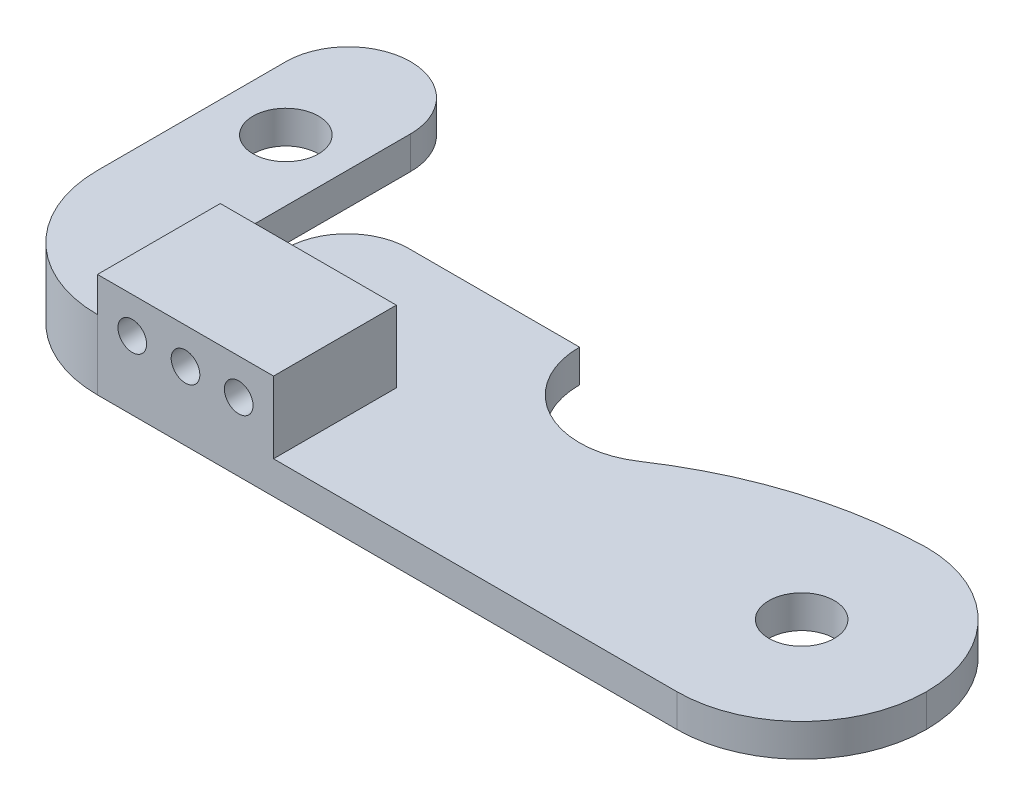
ISO-10303-21;
HEADER;
FILE_DESCRIPTION(('STEP AP214'),'2;1');
FILE_NAME('part.step','',(''),(''),'','','');
FILE_SCHEMA(('AUTOMOTIVE_DESIGN { 1 0 10303 214 1 1 1 1 }'));
ENDSEC;
DATA;
#1=APPLICATION_CONTEXT('core data for automotive mechanical design processes');
#2=APPLICATION_PROTOCOL_DEFINITION('international standard','automotive_design',2000,#1);
#3=PRODUCT_CONTEXT('',#1,'mechanical');
#4=PRODUCT('Part','Part','',(#3));
#5=PRODUCT_RELATED_PRODUCT_CATEGORY('part','',(#4));
#6=PRODUCT_DEFINITION_FORMATION('','',#4);
#7=PRODUCT_DEFINITION_CONTEXT('part definition',#1,'design');
#8=PRODUCT_DEFINITION('design','',#6,#7);
#9=PRODUCT_DEFINITION_SHAPE('','',#8);
#10=(LENGTH_UNIT() NAMED_UNIT(*) SI_UNIT(.MILLI.,.METRE.));
#11=(NAMED_UNIT(*) PLANE_ANGLE_UNIT() SI_UNIT($,.RADIAN.));
#12=(NAMED_UNIT(*) SI_UNIT($,.STERADIAN.) SOLID_ANGLE_UNIT());
#13=UNCERTAINTY_MEASURE_WITH_UNIT(LENGTH_MEASURE(1.E-05),#10,'distance_accuracy_value','');
#14=(GEOMETRIC_REPRESENTATION_CONTEXT(3) GLOBAL_UNCERTAINTY_ASSIGNED_CONTEXT((#13)) GLOBAL_UNIT_ASSIGNED_CONTEXT((#10,
#11,#12)) REPRESENTATION_CONTEXT('',''));
#15=CARTESIAN_POINT('',(0.,0.,0.));
#16=DIRECTION('',(0.,0.,1.));
#17=DIRECTION('',(1.,0.,0.));
#18=AXIS2_PLACEMENT_3D('',#15,#16,#17);
#19=CARTESIAN_POINT('',(-13.6869300911854,3.4,-4.17256838905775));
#20=DIRECTION('',(0.,0.,-1.));
#21=DIRECTION('',(-1.,0.,0.));
#22=AXIS2_PLACEMENT_3D('',#19,#20,#21);
#23=PLANE('',#22);
#24=DIRECTION('',(0.,-1.,0.));
#25=VECTOR('',#24,1.);
#26=CARTESIAN_POINT('',(-19.7869300911854,3.4,-4.17256838905775));
#27=LINE('',#26,#25);
#28=CARTESIAN_POINT('',(-19.7869300911854,1.8,-4.17256838905775));
#29=VERTEX_POINT('',#28);
#30=CARTESIAN_POINT('',(-19.7869300911854,0.,-4.17256838905775));
#31=VERTEX_POINT('',#30);
#32=EDGE_CURVE('E197',#29,#31,#27,.T.);
#33=ORIENTED_EDGE('',*,*,#32,.F.);
#34=DIRECTION('',(-1.,0.,0.));
#35=VECTOR('',#34,1.);
#36=CARTESIAN_POINT('',(-13.6869300911854,1.8,-4.17256838905775));
#37=LINE('',#36,#35);
#38=CARTESIAN_POINT('',(-13.6869300911854,1.8,-4.17256838905775));
#39=VERTEX_POINT('',#38);
#40=EDGE_CURVE('E173',#39,#29,#37,.T.);
#41=ORIENTED_EDGE('',*,*,#40,.F.);
#42=DIRECTION('',(0.,-1.,0.));
#43=VECTOR('',#42,1.);
#44=CARTESIAN_POINT('',(-13.6869300911854,3.4,-4.17256838905775));
#45=LINE('',#44,#43);
#46=CARTESIAN_POINT('',(-13.6869300911854,1.6,-4.17256838905775));
#47=VERTEX_POINT('',#46);
#48=EDGE_CURVE('E205',#39,#47,#45,.T.);
#49=ORIENTED_EDGE('',*,*,#48,.T.);
#50=CARTESIAN_POINT('',(-13.6869300911854,0.,-4.17256838905775));
#51=VERTEX_POINT('',#50);
#52=EDGE_CURVE('E207',#47,#51,#45,.T.);
#53=ORIENTED_EDGE('',*,*,#52,.T.);
#54=DIRECTION('',(1.,0.,0.));
#55=VECTOR('',#54,1.);
#56=CARTESIAN_POINT('',(-13.6869300911854,0.,-4.17256838905775));
#57=LINE('',#56,#55);
#58=EDGE_CURVE('E193',#31,#51,#57,.T.);
#59=ORIENTED_EDGE('',*,*,#58,.F.);
#60=EDGE_LOOP('',(#33,#41,#49,#53,#59));
#61=FACE_BOUND('',#60,.T.);
#62=ADVANCED_FACE('F35',(#61),#23,.T.);
#63=CARTESIAN_POINT('',(-13.6869300911854,1.6,-10.2725683890577));
#64=DIRECTION('',(1.,0.,0.));
#65=DIRECTION('',(0.,0.,-1.));
#66=AXIS2_PLACEMENT_3D('',#63,#64,#65);
#67=PLANE('',#66);
#68=DIRECTION('',(0.,0.,1.));
#69=VECTOR('',#68,1.);
#70=CARTESIAN_POINT('',(-13.6869300911854,3.4,1.92743161094225));
#71=LINE('',#70,#69);
#72=CARTESIAN_POINT('',(-13.6869300911854,3.4,-4.07256838905775));
#73=VERTEX_POINT('',#72);
#74=CARTESIAN_POINT('',(-13.6869300911854,3.4,1.92743161094225));
#75=VERTEX_POINT('',#74);
#76=EDGE_CURVE('E192',#73,#75,#71,.T.);
#77=ORIENTED_EDGE('',*,*,#76,.T.);
#78=DIRECTION('',(0.,-1.,0.));
#79=VECTOR('',#78,1.);
#80=CARTESIAN_POINT('',(-13.6869300911854,1.6,1.92743161094225));
#81=LINE('',#80,#79);
#82=CARTESIAN_POINT('',(-13.6869300911854,5.1,1.92743161094225));
#83=VERTEX_POINT('',#82);
#84=EDGE_CURVE('E278',#83,#75,#81,.T.);
#85=ORIENTED_EDGE('',*,*,#84,.F.);
#86=DIRECTION('',(0.,0.,1.));
#87=VECTOR('',#86,1.);
#88=CARTESIAN_POINT('',(-13.6869300911854,5.1,1.92743161094225));
#89=LINE('',#88,#87);
#90=CARTESIAN_POINT('',(-13.6869300911854,5.1,-4.07256838905775));
#91=VERTEX_POINT('',#90);
#92=EDGE_CURVE('E232',#91,#83,#89,.T.);
#93=ORIENTED_EDGE('',*,*,#92,.F.);
#94=DIRECTION('',(0.,-1.,0.));
#95=VECTOR('',#94,1.);
#96=CARTESIAN_POINT('',(-13.6869300911854,5.1,-4.07256838905775));
#97=LINE('',#96,#95);
#98=EDGE_CURVE('E246',#91,#73,#97,.T.);
#99=ORIENTED_EDGE('',*,*,#98,.T.);
#100=EDGE_LOOP('',(#77,#85,#93,#99));
#101=FACE_BOUND('',#100,.T.);
#102=ADVANCED_FACE('F380',(#101),#67,.F.);
#103=CARTESIAN_POINT('',(0.,1.6,0.));
#104=DIRECTION('',(0.,-1.,0.));
#105=DIRECTION('',(0.,0.,-1.));
#106=AXIS2_PLACEMENT_3D('',#103,#104,#105);
#107=PLANE('',#106);
#108=CARTESIAN_POINT('',(14.6130699088146,1.6,-4.17256838905775));
#109=DIRECTION('',(0.,1.,0.));
#110=DIRECTION('',(0.,0.,1.));
#111=AXIS2_PLACEMENT_3D('',#108,#109,#110);
#112=CIRCLE('',#111,1.6);
#113=CARTESIAN_POINT('',(14.6130699088146,1.6,-2.57256838905775));
#114=VERTEX_POINT('',#113);
#115=EDGE_CURVE('E260',#114,#114,#112,.T.);
#116=ORIENTED_EDGE('',*,*,#115,.F.);
#117=EDGE_LOOP('',(#116));
#118=FACE_BOUND('',#117,.T.);
#119=CARTESIAN_POINT('',(14.6130699088146,1.6,-4.17256838905775));
#120=DIRECTION('',(0.,-1.,0.));
#121=DIRECTION('',(0.,0.,-1.));
#122=AXIS2_PLACEMENT_3D('',#119,#120,#121);
#123=CIRCLE('',#122,6.1);
#124=CARTESIAN_POINT('',(20.7130699088146,1.6,-4.17256838905775));
#125=VERTEX_POINT('',#124);
#126=CARTESIAN_POINT('',(14.6130699088146,1.6,-10.2725683890578));
#127=VERTEX_POINT('',#126);
#128=EDGE_CURVE('E303',#125,#127,#123,.F.);
#129=ORIENTED_EDGE('',*,*,#128,.T.);
#130=CARTESIAN_POINT('',(15.0778954902099,1.6,9.72202931079309));
#131=DIRECTION('',(0.,-1.,0.));
#132=DIRECTION('',(0.,0.,-1.));
#133=AXIS2_PLACEMENT_3D('',#130,#131,#132);
#134=CIRCLE('',#133,20.);
#135=CARTESIAN_POINT('',(3.9636954225215,1.6,-6.90549476392694));
#136=VERTEX_POINT('',#135);
#137=EDGE_CURVE('E57',#127,#136,#134,.F.);
#138=ORIENTED_EDGE('',*,*,#137,.T.);
#139=CARTESIAN_POINT('',(1.71306990881459,1.6,-10.2725683890578));
#140=DIRECTION('',(0.,1.,0.));
#141=DIRECTION('',(0.,0.,1.));
#142=AXIS2_PLACEMENT_3D('',#139,#140,#141);
#143=CIRCLE('',#142,4.05);
#144=CARTESIAN_POINT('',(-2.33693009118541,1.6,-10.2725683890578));
#145=VERTEX_POINT('',#144);
#146=EDGE_CURVE('E266',#145,#136,#143,.T.);
#147=ORIENTED_EDGE('',*,*,#146,.F.);
#148=DIRECTION('',(-1.,0.,0.));
#149=VECTOR('',#148,1.);
#150=CARTESIAN_POINT('',(-13.6869300911854,1.6,-10.2725683890577));
#151=LINE('',#150,#149);
#152=CARTESIAN_POINT('',(-10.6869300911854,1.6,-10.2725683890577));
#153=VERTEX_POINT('',#152);
#154=EDGE_CURVE('E269',#145,#153,#151,.T.);
#155=ORIENTED_EDGE('',*,*,#154,.T.);
#156=CARTESIAN_POINT('',(-10.6869300911854,1.6,-7.27256838905775));
#157=DIRECTION('',(0.,-1.,0.));
#158=DIRECTION('',(0.,0.,-1.));
#159=AXIS2_PLACEMENT_3D('',#156,#157,#158);
#160=CIRCLE('',#159,3.);
#161=CARTESIAN_POINT('',(-13.6869300911854,1.6,-7.27256838905775));
#162=VERTEX_POINT('',#161);
#163=EDGE_CURVE('E294',#153,#162,#160,.F.);
#164=ORIENTED_EDGE('',*,*,#163,.T.);
#165=DIRECTION('',(0.,0.,1.));
#166=VECTOR('',#165,1.);
#167=CARTESIAN_POINT('',(-13.6869300911854,1.6,-10.2725683890577));
#168=LINE('',#167,#166);
#169=EDGE_CURVE('E272',#162,#47,#168,.T.);
#170=ORIENTED_EDGE('',*,*,#169,.T.);
#171=DIRECTION('',(0.,0.,1.));
#172=VECTOR('',#171,1.);
#173=CARTESIAN_POINT('',(-13.6869300911854,1.6,0.));
#174=LINE('',#173,#172);
#175=CARTESIAN_POINT('',(-13.6869300911854,1.6,-4.07256838905775));
#176=VERTEX_POINT('',#175);
#177=EDGE_CURVE('E204',#47,#176,#174,.T.);
#178=ORIENTED_EDGE('',*,*,#177,.T.);
#179=DIRECTION('',(-1.,0.,0.));
#180=VECTOR('',#179,1.);
#181=CARTESIAN_POINT('',(-13.6869300911854,1.6,-4.07256838905775));
#182=LINE('',#181,#180);
#183=CARTESIAN_POINT('',(-5.08693009118541,1.6,-4.07256838905775));
#184=VERTEX_POINT('',#183);
#185=EDGE_CURVE('E236',#184,#176,#182,.T.);
#186=ORIENTED_EDGE('',*,*,#185,.F.);
#187=DIRECTION('',(0.,0.,-1.));
#188=VECTOR('',#187,1.);
#189=CARTESIAN_POINT('',(-5.08693009118541,1.6,1.92743161094225));
#190=LINE('',#189,#188);
#191=CARTESIAN_POINT('',(-5.08693009118542,1.6,1.92743161094225));
#192=VERTEX_POINT('',#191);
#193=EDGE_CURVE('E221',#192,#184,#190,.T.);
#194=ORIENTED_EDGE('',*,*,#193,.F.);
#195=DIRECTION('',(1.,0.,0.));
#196=VECTOR('',#195,1.);
#197=CARTESIAN_POINT('',(-13.6869300911854,1.6,1.92743161094225));
#198=LINE('',#197,#196);
#199=CARTESIAN_POINT('',(14.6130699088146,1.6,1.92743161094225));
#200=VERTEX_POINT('',#199);
#201=EDGE_CURVE('E276',#192,#200,#198,.T.);
#202=ORIENTED_EDGE('',*,*,#201,.T.);
#203=CARTESIAN_POINT('',(14.6130699088146,1.6,-4.17256838905775));
#204=DIRECTION('',(0.,-1.,0.));
#205=DIRECTION('',(0.,0.,-1.));
#206=AXIS2_PLACEMENT_3D('',#203,#204,#205);
#207=CIRCLE('',#206,6.1);
#208=EDGE_CURVE('E305',#200,#125,#207,.F.);
#209=ORIENTED_EDGE('',*,*,#208,.T.);
#210=EDGE_LOOP('',(#129,#138,#147,#155,#164,#170,#178,#186,#194,#202,#209));
#211=FACE_BOUND('',#210,.T.);
#212=ADVANCED_FACE('F323',(#118,#211),#107,.F.);
#213=CARTESIAN_POINT('',(-13.6869300911854,1.6,-10.2725683890577));
#214=DIRECTION('',(0.,0.,1.));
#215=DIRECTION('',(1.,0.,0.));
#216=AXIS2_PLACEMENT_3D('',#213,#214,#215);
#217=PLANE('',#216);
#218=DIRECTION('',(-1.,0.,0.));
#219=VECTOR('',#218,1.);
#220=CARTESIAN_POINT('',(-13.6869300911854,0.,-10.2725683890577));
#221=LINE('',#220,#219);
#222=CARTESIAN_POINT('',(-2.33693009118541,0.,-10.2725683890578));
#223=VERTEX_POINT('',#222);
#224=CARTESIAN_POINT('',(-10.6869300911854,0.,-10.2725683890577));
#225=VERTEX_POINT('',#224);
#226=EDGE_CURVE('E259',#223,#225,#221,.T.);
#227=ORIENTED_EDGE('',*,*,#226,.T.);
#228=DIRECTION('',(0.,-1.,0.));
#229=VECTOR('',#228,1.);
#230=CARTESIAN_POINT('',(-10.6869300911854,1.6,-10.2725683890577));
#231=LINE('',#230,#229);
#232=EDGE_CURVE('E292',#225,#153,#231,.F.);
#233=ORIENTED_EDGE('',*,*,#232,.T.);
#234=ORIENTED_EDGE('',*,*,#154,.F.);
#235=DIRECTION('',(0.,1.,0.));
#236=VECTOR('',#235,1.);
#237=CARTESIAN_POINT('',(-2.33693009118541,0.,-10.2725683890578));
#238=LINE('',#237,#236);
#239=EDGE_CURVE('E263',#223,#145,#238,.T.);
#240=ORIENTED_EDGE('',*,*,#239,.F.);
#241=EDGE_LOOP('',(#227,#233,#234,#240));
#242=FACE_BOUND('',#241,.T.);
#243=ADVANCED_FACE('F420',(#242),#217,.F.);
#244=DIRECTION('',(0.,0.,1.));
#245=VECTOR('',#244,1.);
#246=CARTESIAN_POINT('',(-13.6869300911854,0.,-10.2725683890577));
#247=LINE('',#246,#245);
#248=CARTESIAN_POINT('',(-13.6869300911854,0.,-7.27256838905775));
#249=VERTEX_POINT('',#248);
#250=EDGE_CURVE('E281',#249,#51,#247,.T.);
#251=ORIENTED_EDGE('',*,*,#250,.T.);
#252=ORIENTED_EDGE('',*,*,#52,.F.);
#253=ORIENTED_EDGE('',*,*,#169,.F.);
#254=DIRECTION('',(0.,-1.,0.));
#255=VECTOR('',#254,1.);
#256=CARTESIAN_POINT('',(-13.6869300911854,1.6,-7.27256838905775));
#257=LINE('',#256,#255);
#258=EDGE_CURVE('E287',#162,#249,#257,.T.);
#259=ORIENTED_EDGE('',*,*,#258,.T.);
#260=EDGE_LOOP('',(#251,#252,#253,#259));
#261=FACE_BOUND('',#260,.T.);
#262=ADVANCED_FACE('F359',(#261),#67,.F.);
#263=CARTESIAN_POINT('',(-13.6869300911854,1.6,1.92743161094225));
#264=DIRECTION('',(0.,0.,-1.));
#265=DIRECTION('',(-1.,0.,0.));
#266=AXIS2_PLACEMENT_3D('',#263,#264,#265);
#267=PLANE('',#266);
#268=CARTESIAN_POINT('',(-11.9869300911854,3.35,1.92743161094225));
#269=DIRECTION('',(0.,0.,1.));
#270=DIRECTION('',(1.,0.,0.));
#271=AXIS2_PLACEMENT_3D('',#268,#269,#270);
#272=CIRCLE('',#271,0.7);
#273=CARTESIAN_POINT('',(-11.2869300911854,3.35,1.92743161094225));
#274=VERTEX_POINT('',#273);
#275=EDGE_CURVE('E214',#274,#274,#272,.T.);
#276=ORIENTED_EDGE('',*,*,#275,.F.);
#277=EDGE_LOOP('',(#276));
#278=FACE_BOUND('',#277,.T.);
#279=CARTESIAN_POINT('',(-6.78693009118541,3.35,1.92743161094225));
#280=DIRECTION('',(0.,0.,1.));
#281=DIRECTION('',(1.,0.,0.));
#282=AXIS2_PLACEMENT_3D('',#279,#280,#281);
#283=CIRCLE('',#282,0.7);
#284=CARTESIAN_POINT('',(-6.08693009118541,3.35,1.92743161094225));
#285=VERTEX_POINT('',#284);
#286=EDGE_CURVE('E222',#285,#285,#283,.T.);
#287=ORIENTED_EDGE('',*,*,#286,.F.);
#288=EDGE_LOOP('',(#287));
#289=FACE_BOUND('',#288,.T.);
#290=CARTESIAN_POINT('',(-9.38693009118541,3.35,1.92743161094225));
#291=DIRECTION('',(0.,0.,1.));
#292=DIRECTION('',(1.,0.,0.));
#293=AXIS2_PLACEMENT_3D('',#290,#291,#292);
#294=CIRCLE('',#293,0.7);
#295=CARTESIAN_POINT('',(-8.68693009118541,3.35,1.92743161094225));
#296=VERTEX_POINT('',#295);
#297=EDGE_CURVE('E213',#296,#296,#294,.T.);
#298=ORIENTED_EDGE('',*,*,#297,.F.);
#299=EDGE_LOOP('',(#298));
#300=FACE_BOUND('',#299,.T.);
#301=DIRECTION('',(1.,0.,0.));
#302=VECTOR('',#301,1.);
#303=CARTESIAN_POINT('',(-13.6869300911854,0.,1.92743161094225));
#304=LINE('',#303,#302);
#305=CARTESIAN_POINT('',(-13.6869300911854,0.,1.92743161094225));
#306=VERTEX_POINT('',#305);
#307=CARTESIAN_POINT('',(14.6130699088146,0.,1.92743161094225));
#308=VERTEX_POINT('',#307);
#309=EDGE_CURVE('E273',#306,#308,#304,.T.);
#310=ORIENTED_EDGE('',*,*,#309,.T.);
#311=DIRECTION('',(0.,-1.,0.));
#312=VECTOR('',#311,1.);
#313=CARTESIAN_POINT('',(14.6130699088146,1.6,1.92743161094225));
#314=LINE('',#313,#312);
#315=EDGE_CURVE('E300',#308,#200,#314,.F.);
#316=ORIENTED_EDGE('',*,*,#315,.T.);
#317=ORIENTED_EDGE('',*,*,#201,.F.);
#318=DIRECTION('',(0.,-1.,0.));
#319=VECTOR('',#318,1.);
#320=CARTESIAN_POINT('',(-5.08693009118541,5.1,1.92743161094225));
#321=LINE('',#320,#319);
#322=CARTESIAN_POINT('',(-5.08693009118541,5.1,1.92743161094225));
#323=VERTEX_POINT('',#322);
#324=EDGE_CURVE('E252',#323,#192,#321,.T.);
#325=ORIENTED_EDGE('',*,*,#324,.F.);
#326=DIRECTION('',(1.,0.,0.));
#327=VECTOR('',#326,1.);
#328=CARTESIAN_POINT('',(-13.6869300911854,5.1,1.92743161094225));
#329=LINE('',#328,#327);
#330=EDGE_CURVE('E235',#83,#323,#329,.T.);
#331=ORIENTED_EDGE('',*,*,#330,.F.);
#332=ORIENTED_EDGE('',*,*,#84,.T.);
#333=DIRECTION('',(0.,-1.,0.));
#334=VECTOR('',#333,1.);
#335=CARTESIAN_POINT('',(-13.6869300911854,3.4,1.92743161094225));
#336=LINE('',#335,#334);
#337=EDGE_CURVE('E202',#75,#306,#336,.T.);
#338=ORIENTED_EDGE('',*,*,#337,.T.);
#339=EDGE_LOOP('',(#310,#316,#317,#325,#331,#332,#338));
#340=FACE_BOUND('',#339,.T.);
#341=ADVANCED_FACE('F327',(#278,#289,#300,#340),#267,.F.);
#342=CARTESIAN_POINT('',(0.,0.,0.));
#343=DIRECTION('',(0.,-1.,0.));
#344=DIRECTION('',(0.,0.,-1.));
#345=AXIS2_PLACEMENT_3D('',#342,#343,#344);
#346=PLANE('',#345);
#347=CARTESIAN_POINT('',(14.6130699088146,0.,-4.17256838905775));
#348=DIRECTION('',(0.,1.,0.));
#349=DIRECTION('',(0.,0.,1.));
#350=AXIS2_PLACEMENT_3D('',#347,#348,#349);
#351=CIRCLE('',#350,1.6);
#352=CARTESIAN_POINT('',(14.6130699088146,0.,-2.57256838905775));
#353=VERTEX_POINT('',#352);
#354=EDGE_CURVE('E256',#353,#353,#351,.T.);
#355=ORIENTED_EDGE('',*,*,#354,.T.);
#356=EDGE_LOOP('',(#355));
#357=FACE_BOUND('',#356,.T.);
#358=CARTESIAN_POINT('',(1.71306990881459,0.,-10.2725683890578));
#359=DIRECTION('',(0.,1.,0.));
#360=DIRECTION('',(0.,0.,1.));
#361=AXIS2_PLACEMENT_3D('',#358,#359,#360);
#362=CIRCLE('',#361,4.05);
#363=CARTESIAN_POINT('',(3.9636954225215,0.,-6.90549476392694));
#364=VERTEX_POINT('',#363);
#365=EDGE_CURVE('E264',#223,#364,#362,.T.);
#366=ORIENTED_EDGE('',*,*,#365,.T.);
#367=CARTESIAN_POINT('',(15.0778954902099,0.,9.72202931079309));
#368=DIRECTION('',(0.,-1.,0.));
#369=DIRECTION('',(0.,0.,-1.));
#370=AXIS2_PLACEMENT_3D('',#367,#368,#369);
#371=CIRCLE('',#370,20.);
#372=CARTESIAN_POINT('',(14.6130699088146,0.,-10.2725683890578));
#373=VERTEX_POINT('',#372);
#374=EDGE_CURVE('E11',#364,#373,#371,.T.);
#375=ORIENTED_EDGE('',*,*,#374,.T.);
#376=CARTESIAN_POINT('',(14.6130699088146,0.,-4.17256838905775));
#377=DIRECTION('',(0.,-1.,0.));
#378=DIRECTION('',(0.,0.,-1.));
#379=AXIS2_PLACEMENT_3D('',#376,#377,#378);
#380=CIRCLE('',#379,6.1);
#381=CARTESIAN_POINT('',(20.7130699088146,0.,-4.17256838905775));
#382=VERTEX_POINT('',#381);
#383=EDGE_CURVE('E296',#373,#382,#380,.T.);
#384=ORIENTED_EDGE('',*,*,#383,.T.);
#385=CARTESIAN_POINT('',(14.6130699088146,0.,-4.17256838905775));
#386=DIRECTION('',(0.,-1.,0.));
#387=DIRECTION('',(0.,0.,-1.));
#388=AXIS2_PLACEMENT_3D('',#385,#386,#387);
#389=CIRCLE('',#388,6.1);
#390=EDGE_CURVE('E298',#382,#308,#389,.T.);
#391=ORIENTED_EDGE('',*,*,#390,.T.);
#392=ORIENTED_EDGE('',*,*,#309,.F.);
#393=CARTESIAN_POINT('',(-13.6869300911854,0.,-4.17256838905775));
#394=DIRECTION('',(0.,-1.,0.));
#395=DIRECTION('',(0.,0.,-1.));
#396=AXIS2_PLACEMENT_3D('',#393,#394,#395);
#397=CIRCLE('',#396,6.1);
#398=EDGE_CURVE('E189',#306,#31,#397,.T.);
#399=ORIENTED_EDGE('',*,*,#398,.T.);
#400=ORIENTED_EDGE('',*,*,#58,.T.);
#401=ORIENTED_EDGE('',*,*,#250,.F.);
#402=CARTESIAN_POINT('',(-10.6869300911854,0.,-7.27256838905775));
#403=DIRECTION('',(0.,-1.,0.));
#404=DIRECTION('',(0.,0.,-1.));
#405=AXIS2_PLACEMENT_3D('',#402,#403,#404);
#406=CIRCLE('',#405,3.);
#407=EDGE_CURVE('E290',#249,#225,#406,.T.);
#408=ORIENTED_EDGE('',*,*,#407,.T.);
#409=ORIENTED_EDGE('',*,*,#226,.F.);
#410=EDGE_LOOP('',(#366,#375,#384,#391,#392,#399,#400,#401,#408,#409));
#411=FACE_BOUND('',#410,.T.);
#412=ADVANCED_FACE('F368',(#357,#411),#346,.T.);
#413=CARTESIAN_POINT('',(1.71306990881459,0.,-10.2725683890578));
#414=DIRECTION('',(0.,1.,0.));
#415=DIRECTION('',(0.,0.,1.));
#416=AXIS2_PLACEMENT_3D('',#413,#414,#415);
#417=CYLINDRICAL_SURFACE('',#416,4.05);
#418=ORIENTED_EDGE('',*,*,#146,.T.);
#419=DIRECTION('',(0.,1.,0.));
#420=VECTOR('',#419,1.);
#421=CARTESIAN_POINT('',(3.9636954225215,0.,-6.90549476392694));
#422=LINE('',#421,#420);
#423=EDGE_CURVE('E43',#136,#364,#422,.F.);
#424=ORIENTED_EDGE('',*,*,#423,.T.);
#425=ORIENTED_EDGE('',*,*,#365,.F.);
#426=ORIENTED_EDGE('',*,*,#239,.T.);
#427=EDGE_LOOP('',(#418,#424,#425,#426));
#428=FACE_BOUND('',#427,.T.);
#429=ADVANCED_FACE('F414',(#428),#417,.F.);
#430=CARTESIAN_POINT('',(14.6130699088146,0.,-4.17256838905775));
#431=DIRECTION('',(0.,1.,0.));
#432=DIRECTION('',(0.,0.,1.));
#433=AXIS2_PLACEMENT_3D('',#430,#431,#432);
#434=CYLINDRICAL_SURFACE('',#433,1.6);
#435=ORIENTED_EDGE('',*,*,#354,.F.);
#436=EDGE_LOOP('',(#435));
#437=FACE_BOUND('',#436,.T.);
#438=ORIENTED_EDGE('',*,*,#115,.T.);
#439=EDGE_LOOP('',(#438));
#440=FACE_BOUND('',#439,.T.);
#441=ADVANCED_FACE('F411',(#437,#440),#434,.F.);
#442=CARTESIAN_POINT('',(-10.6869300911854,1.6,-7.27256838905775));
#443=DIRECTION('',(0.,-1.,0.));
#444=DIRECTION('',(0.,0.,-1.));
#445=AXIS2_PLACEMENT_3D('',#442,#443,#444);
#446=CYLINDRICAL_SURFACE('',#445,3.);
#447=ORIENTED_EDGE('',*,*,#163,.F.);
#448=ORIENTED_EDGE('',*,*,#232,.F.);
#449=ORIENTED_EDGE('',*,*,#407,.F.);
#450=ORIENTED_EDGE('',*,*,#258,.F.);
#451=EDGE_LOOP('',(#447,#448,#449,#450));
#452=FACE_BOUND('',#451,.T.);
#453=ADVANCED_FACE('F366',(#452),#446,.T.);
#454=CARTESIAN_POINT('',(14.6130699088146,1.6,-4.17256838905775));
#455=DIRECTION('',(0.,-1.,0.));
#456=DIRECTION('',(0.,0.,-1.));
#457=AXIS2_PLACEMENT_3D('',#454,#455,#456);
#458=CYLINDRICAL_SURFACE('',#457,6.1);
#459=DIRECTION('',(0.,-1.,0.));
#460=VECTOR('',#459,1.);
#461=CARTESIAN_POINT('',(14.6130699088146,1.6,-10.2725683890578));
#462=LINE('',#461,#460);
#463=EDGE_CURVE('E307',#127,#373,#462,.T.);
#464=ORIENTED_EDGE('',*,*,#463,.F.);
#465=ORIENTED_EDGE('',*,*,#128,.F.);
#466=DIRECTION('',(0.,-1.,0.));
#467=VECTOR('',#466,1.);
#468=CARTESIAN_POINT('',(20.7130699088146,1.6,-4.17256838905775));
#469=LINE('',#468,#467);
#470=EDGE_CURVE('E255',#382,#125,#469,.F.);
#471=ORIENTED_EDGE('',*,*,#470,.F.);
#472=ORIENTED_EDGE('',*,*,#383,.F.);
#473=EDGE_LOOP('',(#464,#465,#471,#472));
#474=FACE_BOUND('',#473,.T.);
#475=ADVANCED_FACE('F322',(#474),#458,.T.);
#476=CARTESIAN_POINT('',(14.6130699088146,1.6,-4.17256838905775));
#477=DIRECTION('',(0.,-1.,0.));
#478=DIRECTION('',(0.,0.,-1.));
#479=AXIS2_PLACEMENT_3D('',#476,#477,#478);
#480=CYLINDRICAL_SURFACE('',#479,6.1);
#481=ORIENTED_EDGE('',*,*,#208,.F.);
#482=ORIENTED_EDGE('',*,*,#315,.F.);
#483=ORIENTED_EDGE('',*,*,#390,.F.);
#484=ORIENTED_EDGE('',*,*,#470,.T.);
#485=EDGE_LOOP('',(#481,#482,#483,#484));
#486=FACE_BOUND('',#485,.T.);
#487=ADVANCED_FACE('F316',(#486),#480,.T.);
#488=CARTESIAN_POINT('',(-5.08693009118541,5.1,1.92743161094225));
#489=DIRECTION('',(-1.,0.,0.));
#490=DIRECTION('',(0.,0.,1.));
#491=AXIS2_PLACEMENT_3D('',#488,#489,#490);
#492=PLANE('',#491);
#493=ORIENTED_EDGE('',*,*,#193,.T.);
#494=DIRECTION('',(0.,-1.,0.));
#495=VECTOR('',#494,1.);
#496=CARTESIAN_POINT('',(-5.08693009118541,5.1,-4.07256838905775));
#497=LINE('',#496,#495);
#498=CARTESIAN_POINT('',(-5.08693009118541,5.1,-4.07256838905775));
#499=VERTEX_POINT('',#498);
#500=EDGE_CURVE('E249',#499,#184,#497,.T.);
#501=ORIENTED_EDGE('',*,*,#500,.F.);
#502=DIRECTION('',(0.,0.,-1.));
#503=VECTOR('',#502,1.);
#504=CARTESIAN_POINT('',(-5.08693009118541,5.1,1.92743161094225));
#505=LINE('',#504,#503);
#506=EDGE_CURVE('E238',#323,#499,#505,.T.);
#507=ORIENTED_EDGE('',*,*,#506,.F.);
#508=ORIENTED_EDGE('',*,*,#324,.T.);
#509=EDGE_LOOP('',(#493,#501,#507,#508));
#510=FACE_BOUND('',#509,.T.);
#511=ADVANCED_FACE('F331',(#510),#492,.F.);
#512=CARTESIAN_POINT('',(-13.6869300911854,5.1,-4.07256838905775));
#513=DIRECTION('',(0.,0.,1.));
#514=DIRECTION('',(1.,0.,0.));
#515=AXIS2_PLACEMENT_3D('',#512,#513,#514);
#516=PLANE('',#515);
#517=CARTESIAN_POINT('',(-11.9869300911854,3.35,-4.07256838905775));
#518=DIRECTION('',(0.,0.,1.));
#519=DIRECTION('',(1.,0.,0.));
#520=AXIS2_PLACEMENT_3D('',#517,#518,#519);
#521=CIRCLE('',#520,0.7);
#522=CARTESIAN_POINT('',(-11.2869300911854,3.35,-4.07256838905775));
#523=VERTEX_POINT('',#522);
#524=EDGE_CURVE('E217',#523,#523,#521,.F.);
#525=ORIENTED_EDGE('',*,*,#524,.F.);
#526=EDGE_LOOP('',(#525));
#527=FACE_BOUND('',#526,.T.);
#528=CARTESIAN_POINT('',(-6.78693009118541,3.35,-4.07256838905775));
#529=DIRECTION('',(0.,0.,1.));
#530=DIRECTION('',(1.,0.,0.));
#531=AXIS2_PLACEMENT_3D('',#528,#529,#530);
#532=CIRCLE('',#531,0.7);
#533=CARTESIAN_POINT('',(-6.08693009118541,3.35,-4.07256838905775));
#534=VERTEX_POINT('',#533);
#535=EDGE_CURVE('E218',#534,#534,#532,.F.);
#536=ORIENTED_EDGE('',*,*,#535,.F.);
#537=EDGE_LOOP('',(#536));
#538=FACE_BOUND('',#537,.T.);
#539=CARTESIAN_POINT('',(-9.38693009118541,3.35,-4.07256838905775));
#540=DIRECTION('',(0.,0.,1.));
#541=DIRECTION('',(1.,0.,0.));
#542=AXIS2_PLACEMENT_3D('',#539,#540,#541);
#543=CIRCLE('',#542,0.7);
#544=CARTESIAN_POINT('',(-8.68693009118541,3.35,-4.07256838905775));
#545=VERTEX_POINT('',#544);
#546=EDGE_CURVE('E225',#545,#545,#543,.F.);
#547=ORIENTED_EDGE('',*,*,#546,.F.);
#548=EDGE_LOOP('',(#547));
#549=FACE_BOUND('',#548,.T.);
#550=ORIENTED_EDGE('',*,*,#185,.T.);
#551=EDGE_CURVE('E242',#73,#176,#97,.T.);
#552=ORIENTED_EDGE('',*,*,#551,.F.);
#553=ORIENTED_EDGE('',*,*,#98,.F.);
#554=DIRECTION('',(-1.,0.,0.));
#555=VECTOR('',#554,1.);
#556=CARTESIAN_POINT('',(-13.6869300911854,5.1,-4.07256838905775));
#557=LINE('',#556,#555);
#558=EDGE_CURVE('E240',#499,#91,#557,.T.);
#559=ORIENTED_EDGE('',*,*,#558,.F.);
#560=ORIENTED_EDGE('',*,*,#500,.T.);
#561=EDGE_LOOP('',(#550,#552,#553,#559,#560));
#562=FACE_BOUND('',#561,.T.);
#563=ADVANCED_FACE('F405',(#527,#538,#549,#562),#516,.F.);
#564=CARTESIAN_POINT('',(0.,5.1,0.));
#565=DIRECTION('',(0.,-1.,0.));
#566=DIRECTION('',(0.,0.,-1.));
#567=AXIS2_PLACEMENT_3D('',#564,#565,#566);
#568=PLANE('',#567);
#569=ORIENTED_EDGE('',*,*,#92,.T.);
#570=ORIENTED_EDGE('',*,*,#330,.T.);
#571=ORIENTED_EDGE('',*,*,#506,.T.);
#572=ORIENTED_EDGE('',*,*,#558,.T.);
#573=EDGE_LOOP('',(#569,#570,#571,#572));
#574=FACE_BOUND('',#573,.T.);
#575=ADVANCED_FACE('F335',(#574),#568,.F.);
#576=CARTESIAN_POINT('',(-9.38693009118541,3.35,-6.05246737638008));
#577=DIRECTION('',(0.,0.,1.));
#578=DIRECTION('',(1.,0.,0.));
#579=AXIS2_PLACEMENT_3D('',#576,#577,#578);
#580=CYLINDRICAL_SURFACE('',#579,0.7);
#581=ORIENTED_EDGE('',*,*,#546,.T.);
#582=EDGE_LOOP('',(#581));
#583=FACE_BOUND('',#582,.T.);
#584=ORIENTED_EDGE('',*,*,#297,.T.);
#585=EDGE_LOOP('',(#584));
#586=FACE_BOUND('',#585,.T.);
#587=ADVANCED_FACE('F398',(#583,#586),#580,.F.);
#588=CARTESIAN_POINT('',(-6.78693009118541,3.35,-6.05246737638008));
#589=DIRECTION('',(0.,0.,1.));
#590=DIRECTION('',(1.,0.,0.));
#591=AXIS2_PLACEMENT_3D('',#588,#589,#590);
#592=CYLINDRICAL_SURFACE('',#591,0.7);
#593=ORIENTED_EDGE('',*,*,#535,.T.);
#594=EDGE_LOOP('',(#593));
#595=FACE_BOUND('',#594,.T.);
#596=ORIENTED_EDGE('',*,*,#286,.T.);
#597=EDGE_LOOP('',(#596));
#598=FACE_BOUND('',#597,.T.);
#599=ADVANCED_FACE('F394',(#595,#598),#592,.F.);
#600=CARTESIAN_POINT('',(-11.9869300911854,3.35,-6.05246737638008));
#601=DIRECTION('',(0.,0.,1.));
#602=DIRECTION('',(1.,0.,0.));
#603=AXIS2_PLACEMENT_3D('',#600,#601,#602);
#604=CYLINDRICAL_SURFACE('',#603,0.7);
#605=ORIENTED_EDGE('',*,*,#524,.T.);
#606=EDGE_LOOP('',(#605));
#607=FACE_BOUND('',#606,.T.);
#608=ORIENTED_EDGE('',*,*,#275,.T.);
#609=EDGE_LOOP('',(#608));
#610=FACE_BOUND('',#609,.T.);
#611=ADVANCED_FACE('F391',(#607,#610),#604,.F.);
#612=CARTESIAN_POINT('',(-13.6869300911854,3.4,1.92743161094225));
#613=DIRECTION('',(1.,0.,0.));
#614=DIRECTION('',(0.,0.,-1.));
#615=AXIS2_PLACEMENT_3D('',#612,#613,#614);
#616=PLANE('',#615);
#617=ORIENTED_EDGE('',*,*,#177,.F.);
#618=ORIENTED_EDGE('',*,*,#48,.F.);
#619=DIRECTION('',(0.,0.,1.));
#620=VECTOR('',#619,1.);
#621=CARTESIAN_POINT('',(-13.6869300911854,1.8,-13.3725683890578));
#622=LINE('',#621,#620);
#623=CARTESIAN_POINT('',(-13.6869300911854,1.8,-13.3725683890578));
#624=VERTEX_POINT('',#623);
#625=EDGE_CURVE('E174',#624,#39,#622,.T.);
#626=ORIENTED_EDGE('',*,*,#625,.F.);
#627=DIRECTION('',(0.,-1.,0.));
#628=VECTOR('',#627,1.);
#629=CARTESIAN_POINT('',(-13.6869300911854,3.4,-13.3725683890578));
#630=LINE('',#629,#628);
#631=CARTESIAN_POINT('',(-13.6869300911854,3.4,-13.3725683890578));
#632=VERTEX_POINT('',#631);
#633=EDGE_CURVE('E164',#632,#624,#630,.T.);
#634=ORIENTED_EDGE('',*,*,#633,.F.);
#635=EDGE_CURVE('E194',#632,#73,#71,.T.);
#636=ORIENTED_EDGE('',*,*,#635,.T.);
#637=ORIENTED_EDGE('',*,*,#551,.T.);
#638=EDGE_LOOP('',(#617,#618,#626,#634,#636,#637));
#639=FACE_BOUND('',#638,.T.);
#640=ADVANCED_FACE('F351',(#639),#616,.T.);
#641=CARTESIAN_POINT('',(-13.6869300911854,3.4,-4.17256838905775));
#642=DIRECTION('',(0.,-1.,0.));
#643=DIRECTION('',(0.,0.,-1.));
#644=AXIS2_PLACEMENT_3D('',#641,#642,#643);
#645=CYLINDRICAL_SURFACE('',#644,6.1);
#646=ORIENTED_EDGE('',*,*,#398,.F.);
#647=ORIENTED_EDGE('',*,*,#337,.F.);
#648=CARTESIAN_POINT('',(-13.6869300911854,3.4,-4.17256838905775));
#649=DIRECTION('',(0.,-1.,0.));
#650=DIRECTION('',(0.,0.,-1.));
#651=AXIS2_PLACEMENT_3D('',#648,#649,#650);
#652=CIRCLE('',#651,6.1);
#653=CARTESIAN_POINT('',(-19.7869300911854,3.4,-4.17256838905775));
#654=VERTEX_POINT('',#653);
#655=EDGE_CURVE('E190',#75,#654,#652,.T.);
#656=ORIENTED_EDGE('',*,*,#655,.T.);
#657=EDGE_CURVE('E208',#654,#29,#27,.T.);
#658=ORIENTED_EDGE('',*,*,#657,.T.);
#659=ORIENTED_EDGE('',*,*,#32,.T.);
#660=EDGE_LOOP('',(#646,#647,#656,#658,#659));
#661=FACE_BOUND('',#660,.T.);
#662=ADVANCED_FACE('F344',(#661),#645,.T.);
#663=CARTESIAN_POINT('',(-13.6869300911854,3.4,-4.17256838905775));
#664=DIRECTION('',(0.,-1.,0.));
#665=DIRECTION('',(0.,0.,-1.));
#666=AXIS2_PLACEMENT_3D('',#663,#664,#665);
#667=PLANE('',#666);
#668=CARTESIAN_POINT('',(-16.6869300911854,3.4,-10.2725683890578));
#669=DIRECTION('',(0.,1.,0.));
#670=DIRECTION('',(0.,0.,1.));
#671=AXIS2_PLACEMENT_3D('',#668,#669,#670);
#672=CIRCLE('',#671,1.6);
#673=CARTESIAN_POINT('',(-16.6869300911854,3.4,-8.67256838905775));
#674=VERTEX_POINT('',#673);
#675=EDGE_CURVE('E624',#674,#674,#672,.T.);
#676=ORIENTED_EDGE('',*,*,#675,.F.);
#677=EDGE_LOOP('',(#676));
#678=FACE_BOUND('',#677,.T.);
#679=ORIENTED_EDGE('',*,*,#655,.F.);
#680=ORIENTED_EDGE('',*,*,#76,.F.);
#681=ORIENTED_EDGE('',*,*,#635,.F.);
#682=CARTESIAN_POINT('',(-16.7369300911854,3.4,-13.3725683890578));
#683=DIRECTION('',(0.,1.,0.));
#684=DIRECTION('',(0.,0.,1.));
#685=AXIS2_PLACEMENT_3D('',#682,#683,#684);
#686=CIRCLE('',#685,3.05);
#687=CARTESIAN_POINT('',(-19.7869300911854,3.4,-13.3725683890578));
#688=VERTEX_POINT('',#687);
#689=EDGE_CURVE('E178',#632,#688,#686,.T.);
#690=ORIENTED_EDGE('',*,*,#689,.T.);
#691=DIRECTION('',(0.,0.,1.));
#692=VECTOR('',#691,1.);
#693=CARTESIAN_POINT('',(-19.7869300911854,3.4,-13.3725683890578));
#694=LINE('',#693,#692);
#695=EDGE_CURVE('E159',#688,#654,#694,.T.);
#696=ORIENTED_EDGE('',*,*,#695,.T.);
#697=EDGE_LOOP('',(#679,#680,#681,#690,#696));
#698=FACE_BOUND('',#697,.T.);
#699=ADVANCED_FACE('F347',(#678,#698),#667,.F.);
#700=CARTESIAN_POINT('',(-13.6869300911854,1.8,-13.3725683890578));
#701=DIRECTION('',(0.,1.,0.));
#702=DIRECTION('',(0.,0.,1.));
#703=AXIS2_PLACEMENT_3D('',#700,#701,#702);
#704=PLANE('',#703);
#705=CARTESIAN_POINT('',(-16.6869300911854,1.8,-10.2725683890578));
#706=DIRECTION('',(0.,1.,0.));
#707=DIRECTION('',(0.,0.,1.));
#708=AXIS2_PLACEMENT_3D('',#705,#706,#707);
#709=CIRCLE('',#708,1.6);
#710=CARTESIAN_POINT('',(-16.6869300911854,1.8,-8.67256838905775));
#711=VERTEX_POINT('',#710);
#712=EDGE_CURVE('E181',#711,#711,#709,.F.);
#713=ORIENTED_EDGE('',*,*,#712,.F.);
#714=EDGE_LOOP('',(#713));
#715=FACE_BOUND('',#714,.T.);
#716=ORIENTED_EDGE('',*,*,#40,.T.);
#717=DIRECTION('',(0.,0.,1.));
#718=VECTOR('',#717,1.);
#719=CARTESIAN_POINT('',(-19.7869300911854,1.8,-13.3725683890578));
#720=LINE('',#719,#718);
#721=CARTESIAN_POINT('',(-19.7869300911854,1.8,-13.3725683890578));
#722=VERTEX_POINT('',#721);
#723=EDGE_CURVE('E157',#722,#29,#720,.T.);
#724=ORIENTED_EDGE('',*,*,#723,.F.);
#725=CARTESIAN_POINT('',(-16.7369300911854,1.8,-13.3725683890578));
#726=DIRECTION('',(0.,1.,0.));
#727=DIRECTION('',(0.,0.,1.));
#728=AXIS2_PLACEMENT_3D('',#725,#726,#727);
#729=CIRCLE('',#728,3.05);
#730=EDGE_CURVE('E171',#722,#624,#729,.F.);
#731=ORIENTED_EDGE('',*,*,#730,.T.);
#732=ORIENTED_EDGE('',*,*,#625,.T.);
#733=EDGE_LOOP('',(#716,#724,#731,#732));
#734=FACE_BOUND('',#733,.T.);
#735=ADVANCED_FACE('F169',(#715,#734),#704,.F.);
#736=CARTESIAN_POINT('',(-19.7869300911854,3.4,-13.3725683890578));
#737=DIRECTION('',(1.,0.,0.));
#738=DIRECTION('',(0.,0.,-1.));
#739=AXIS2_PLACEMENT_3D('',#736,#737,#738);
#740=PLANE('',#739);
#741=ORIENTED_EDGE('',*,*,#657,.F.);
#742=ORIENTED_EDGE('',*,*,#695,.F.);
#743=DIRECTION('',(0.,1.,0.));
#744=VECTOR('',#743,1.);
#745=CARTESIAN_POINT('',(-19.7869300911854,3.4,-13.3725683890578));
#746=LINE('',#745,#744);
#747=EDGE_CURVE('E153',#722,#688,#746,.T.);
#748=ORIENTED_EDGE('',*,*,#747,.F.);
#749=ORIENTED_EDGE('',*,*,#723,.T.);
#750=EDGE_LOOP('',(#741,#742,#748,#749));
#751=FACE_BOUND('',#750,.T.);
#752=ADVANCED_FACE('F156',(#751),#740,.F.);
#753=CARTESIAN_POINT('',(-16.7369300911854,-5.02000733137436,-13.3725683890578));
#754=DIRECTION('',(0.,1.,0.));
#755=DIRECTION('',(0.,0.,1.));
#756=AXIS2_PLACEMENT_3D('',#753,#754,#755);
#757=CYLINDRICAL_SURFACE('',#756,3.05);
#758=ORIENTED_EDGE('',*,*,#730,.F.);
#759=ORIENTED_EDGE('',*,*,#747,.T.);
#760=ORIENTED_EDGE('',*,*,#689,.F.);
#761=ORIENTED_EDGE('',*,*,#633,.T.);
#762=EDGE_LOOP('',(#758,#759,#760,#761));
#763=FACE_BOUND('',#762,.T.);
#764=ADVANCED_FACE('F176',(#763),#757,.T.);
#765=CARTESIAN_POINT('',(-16.6869300911854,-2.72548339959391,-10.2725683890578));
#766=DIRECTION('',(0.,1.,0.));
#767=DIRECTION('',(0.,0.,1.));
#768=AXIS2_PLACEMENT_3D('',#765,#766,#767);
#769=CYLINDRICAL_SURFACE('',#768,1.6);
#770=ORIENTED_EDGE('',*,*,#712,.T.);
#771=EDGE_LOOP('',(#770));
#772=FACE_BOUND('',#771,.T.);
#773=ORIENTED_EDGE('',*,*,#675,.T.);
#774=EDGE_LOOP('',(#773));
#775=FACE_BOUND('',#774,.T.);
#776=ADVANCED_FACE('F373',(#772,#775),#769,.F.);
#777=CARTESIAN_POINT('',(15.0778954902099,0.,9.72202931079309));
#778=DIRECTION('',(0.,1.,0.));
#779=DIRECTION('',(0.,0.,1.));
#780=AXIS2_PLACEMENT_3D('',#777,#778,#779);
#781=CYLINDRICAL_SURFACE('',#780,20.);
#782=ORIENTED_EDGE('',*,*,#374,.F.);
#783=ORIENTED_EDGE('',*,*,#423,.F.);
#784=ORIENTED_EDGE('',*,*,#137,.F.);
#785=ORIENTED_EDGE('',*,*,#463,.T.);
#786=EDGE_LOOP('',(#782,#783,#784,#785));
#787=FACE_BOUND('',#786,.T.);
#788=ADVANCED_FACE('F37',(#787),#781,.T.);
#789=CLOSED_SHELL('',(#62,#102,#212,#243,#262,#341,#412,#429,#441,#453,#475,#487,#511,#563,#575,
#587,#599,#611,#640,#662,#699,#735,#752,#764,#776,#788));
#790=MANIFOLD_SOLID_BREP('B2',#789);
#791=ADVANCED_BREP_SHAPE_REPRESENTATION('',(#18,#790),#14);
#792=SHAPE_DEFINITION_REPRESENTATION(#9,#791);
ENDSEC;
END-ISO-10303-21;
